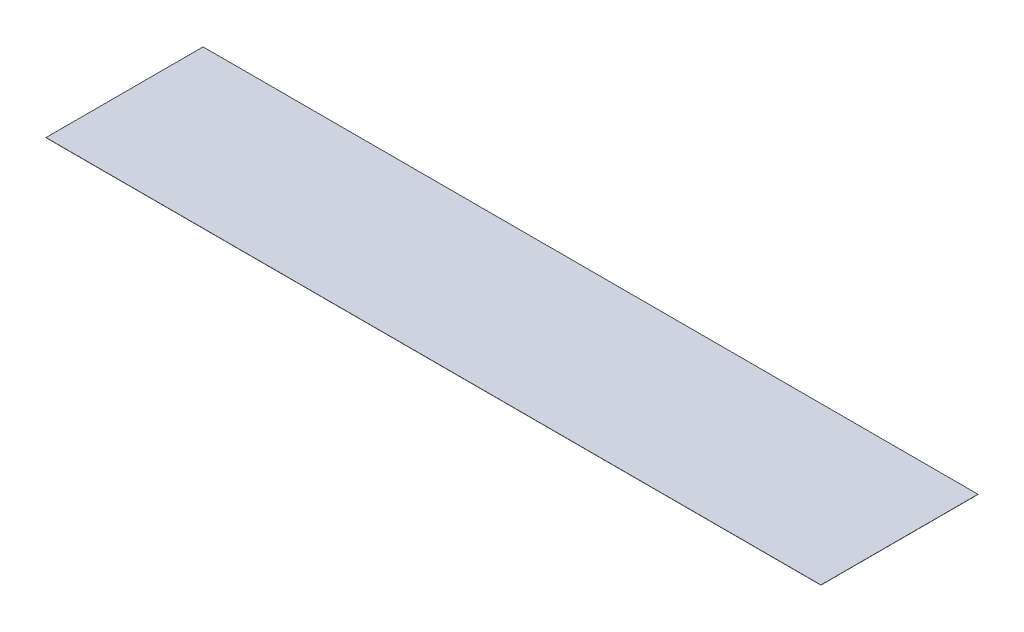
ISO-10303-21;
HEADER;
FILE_DESCRIPTION(('STEP AP214'),'2;1');
FILE_NAME('part.step','',(''),(''),'','','');
FILE_SCHEMA(('AUTOMOTIVE_DESIGN { 1 0 10303 214 1 1 1 1 }'));
ENDSEC;
DATA;
#1=APPLICATION_CONTEXT('core data for automotive mechanical design processes');
#2=APPLICATION_PROTOCOL_DEFINITION('international standard','automotive_design',2000,#1);
#3=PRODUCT_CONTEXT('',#1,'mechanical');
#4=PRODUCT('Part','Part','',(#3));
#5=PRODUCT_RELATED_PRODUCT_CATEGORY('part','',(#4));
#6=PRODUCT_DEFINITION_FORMATION('','',#4);
#7=PRODUCT_DEFINITION_CONTEXT('part definition',#1,'design');
#8=PRODUCT_DEFINITION('design','',#6,#7);
#9=PRODUCT_DEFINITION_SHAPE('','',#8);
#10=(LENGTH_UNIT() NAMED_UNIT(*) SI_UNIT(.MILLI.,.METRE.));
#11=(NAMED_UNIT(*) PLANE_ANGLE_UNIT() SI_UNIT($,.RADIAN.));
#12=(NAMED_UNIT(*) SI_UNIT($,.STERADIAN.) SOLID_ANGLE_UNIT());
#13=UNCERTAINTY_MEASURE_WITH_UNIT(LENGTH_MEASURE(1.E-05),#10,'distance_accuracy_value','');
#14=(GEOMETRIC_REPRESENTATION_CONTEXT(3) GLOBAL_UNCERTAINTY_ASSIGNED_CONTEXT((#13)) GLOBAL_UNIT_ASSIGNED_CONTEXT((#10,
#11,#12)) REPRESENTATION_CONTEXT('',''));
#15=CARTESIAN_POINT('',(0.,0.,0.));
#16=DIRECTION('',(0.,0.,1.));
#17=DIRECTION('',(1.,0.,0.));
#18=AXIS2_PLACEMENT_3D('',#15,#16,#17);
#19=CARTESIAN_POINT('',(-11277.6,4.7752,0.));
#20=DIRECTION('',(1.,0.,0.));
#21=DIRECTION('',(0.,0.,-1.));
#22=AXIS2_PLACEMENT_3D('',#19,#20,#21);
#23=PLANE('',#22);
#24=DIRECTION('',(0.,0.,1.));
#25=VECTOR('',#24,1.);
#26=CARTESIAN_POINT('',(-11277.6,0.,0.));
#27=LINE('',#26,#25);
#28=CARTESIAN_POINT('',(-11277.6,0.,-4572.));
#29=VERTEX_POINT('',#28);
#30=CARTESIAN_POINT('',(-11277.6,0.,0.));
#31=VERTEX_POINT('',#30);
#32=EDGE_CURVE('E104',#29,#31,#27,.T.);
#33=ORIENTED_EDGE('',*,*,#32,.T.);
#34=DIRECTION('',(0.,-1.,0.));
#35=VECTOR('',#34,1.);
#36=CARTESIAN_POINT('',(-11277.6,4.7752,0.));
#37=LINE('',#36,#35);
#38=CARTESIAN_POINT('',(-11277.6,4.7752,0.));
#39=VERTEX_POINT('',#38);
#40=EDGE_CURVE('E11',#39,#31,#37,.T.);
#41=ORIENTED_EDGE('',*,*,#40,.F.);
#42=DIRECTION('',(0.,0.,1.));
#43=VECTOR('',#42,1.);
#44=CARTESIAN_POINT('',(-11277.6,4.7752,0.));
#45=LINE('',#44,#43);
#46=CARTESIAN_POINT('',(-11277.6,4.7752,-4572.));
#47=VERTEX_POINT('',#46);
#48=EDGE_CURVE('E91',#47,#39,#45,.T.);
#49=ORIENTED_EDGE('',*,*,#48,.F.);
#50=DIRECTION('',(0.,-1.,0.));
#51=VECTOR('',#50,1.);
#52=CARTESIAN_POINT('',(-11277.6,4.7752,-4572.));
#53=LINE('',#52,#51);
#54=EDGE_CURVE('E100',#47,#29,#53,.T.);
#55=ORIENTED_EDGE('',*,*,#54,.T.);
#56=EDGE_LOOP('',(#33,#41,#49,#55));
#57=FACE_BOUND('',#56,.T.);
#58=ADVANCED_FACE('F40',(#57),#23,.F.);
#59=CARTESIAN_POINT('',(-11277.6,4.7752,0.));
#60=DIRECTION('',(0.,0.,-1.));
#61=DIRECTION('',(-1.,0.,0.));
#62=AXIS2_PLACEMENT_3D('',#59,#60,#61);
#63=PLANE('',#62);
#64=DIRECTION('',(1.,0.,0.));
#65=VECTOR('',#64,1.);
#66=CARTESIAN_POINT('',(-11277.6,0.,0.));
#67=LINE('',#66,#65);
#68=CARTESIAN_POINT('',(11277.6,0.,-4.21884749357559E-12));
#69=VERTEX_POINT('',#68);
#70=EDGE_CURVE('E96',#31,#69,#67,.T.);
#71=ORIENTED_EDGE('',*,*,#70,.T.);
#72=DIRECTION('',(0.,-1.,0.));
#73=VECTOR('',#72,1.);
#74=CARTESIAN_POINT('',(11277.6,4.7752,-4.21884749357559E-12));
#75=LINE('',#74,#73);
#76=CARTESIAN_POINT('',(11277.6,4.7752,-4.21884749357559E-12));
#77=VERTEX_POINT('',#76);
#78=EDGE_CURVE('E48',#77,#69,#75,.T.);
#79=ORIENTED_EDGE('',*,*,#78,.F.);
#80=DIRECTION('',(1.,0.,0.));
#81=VECTOR('',#80,1.);
#82=CARTESIAN_POINT('',(-11277.6,4.7752,0.));
#83=LINE('',#82,#81);
#84=EDGE_CURVE('E86',#39,#77,#83,.T.);
#85=ORIENTED_EDGE('',*,*,#84,.F.);
#86=ORIENTED_EDGE('',*,*,#40,.T.);
#87=EDGE_LOOP('',(#71,#79,#85,#86));
#88=FACE_BOUND('',#87,.T.);
#89=ADVANCED_FACE('F95',(#88),#63,.F.);
#90=CARTESIAN_POINT('',(11277.6,4.7752,-4.21884749357559E-12));
#91=DIRECTION('',(-1.,0.,0.));
#92=DIRECTION('',(0.,0.,1.));
#93=AXIS2_PLACEMENT_3D('',#90,#91,#92);
#94=PLANE('',#93);
#95=DIRECTION('',(0.,0.,-1.));
#96=VECTOR('',#95,1.);
#97=CARTESIAN_POINT('',(11277.6,0.,-4.21884749357559E-12));
#98=LINE('',#97,#96);
#99=CARTESIAN_POINT('',(11277.6,0.,-4572.));
#100=VERTEX_POINT('',#99);
#101=EDGE_CURVE('E73',#69,#100,#98,.T.);
#102=ORIENTED_EDGE('',*,*,#101,.T.);
#103=DIRECTION('',(0.,-1.,0.));
#104=VECTOR('',#103,1.);
#105=CARTESIAN_POINT('',(11277.6,4.7752,-4572.));
#106=LINE('',#105,#104);
#107=CARTESIAN_POINT('',(11277.6,4.7752,-4572.));
#108=VERTEX_POINT('',#107);
#109=EDGE_CURVE('E97',#108,#100,#106,.T.);
#110=ORIENTED_EDGE('',*,*,#109,.F.);
#111=DIRECTION('',(0.,0.,-1.));
#112=VECTOR('',#111,1.);
#113=CARTESIAN_POINT('',(11277.6,4.7752,-4.21884749357559E-12));
#114=LINE('',#113,#112);
#115=EDGE_CURVE('E89',#77,#108,#114,.T.);
#116=ORIENTED_EDGE('',*,*,#115,.F.);
#117=ORIENTED_EDGE('',*,*,#78,.T.);
#118=EDGE_LOOP('',(#102,#110,#116,#117));
#119=FACE_BOUND('',#118,.T.);
#120=ADVANCED_FACE('F98',(#119),#94,.F.);
#121=CARTESIAN_POINT('',(-11277.6,4.7752,-4572.));
#122=DIRECTION('',(0.,0.,1.));
#123=DIRECTION('',(1.,0.,0.));
#124=AXIS2_PLACEMENT_3D('',#121,#122,#123);
#125=PLANE('',#124);
#126=DIRECTION('',(-1.,0.,0.));
#127=VECTOR('',#126,1.);
#128=CARTESIAN_POINT('',(-11277.6,0.,-4572.));
#129=LINE('',#128,#127);
#130=EDGE_CURVE('E79',#100,#29,#129,.T.);
#131=ORIENTED_EDGE('',*,*,#130,.T.);
#132=ORIENTED_EDGE('',*,*,#54,.F.);
#133=DIRECTION('',(-1.,0.,0.));
#134=VECTOR('',#133,1.);
#135=CARTESIAN_POINT('',(-11277.6,4.7752,-4572.));
#136=LINE('',#135,#134);
#137=EDGE_CURVE('E56',#108,#47,#136,.T.);
#138=ORIENTED_EDGE('',*,*,#137,.F.);
#139=ORIENTED_EDGE('',*,*,#109,.T.);
#140=EDGE_LOOP('',(#131,#132,#138,#139));
#141=FACE_BOUND('',#140,.T.);
#142=ADVANCED_FACE('F112',(#141),#125,.F.);
#143=CARTESIAN_POINT('',(0.,4.7752,0.));
#144=DIRECTION('',(0.,-1.,0.));
#145=DIRECTION('',(0.,0.,-1.));
#146=AXIS2_PLACEMENT_3D('',#143,#144,#145);
#147=PLANE('',#146);
#148=ORIENTED_EDGE('',*,*,#48,.T.);
#149=ORIENTED_EDGE('',*,*,#84,.T.);
#150=ORIENTED_EDGE('',*,*,#115,.T.);
#151=ORIENTED_EDGE('',*,*,#137,.T.);
#152=EDGE_LOOP('',(#148,#149,#150,#151));
#153=FACE_BOUND('',#152,.T.);
#154=ADVANCED_FACE('F87',(#153),#147,.F.);
#155=CARTESIAN_POINT('',(0.,0.,0.));
#156=DIRECTION('',(0.,-1.,0.));
#157=DIRECTION('',(0.,0.,-1.));
#158=AXIS2_PLACEMENT_3D('',#155,#156,#157);
#159=PLANE('',#158);
#160=ORIENTED_EDGE('',*,*,#32,.F.);
#161=ORIENTED_EDGE('',*,*,#130,.F.);
#162=ORIENTED_EDGE('',*,*,#101,.F.);
#163=ORIENTED_EDGE('',*,*,#70,.F.);
#164=EDGE_LOOP('',(#160,#161,#162,#163));
#165=FACE_BOUND('',#164,.T.);
#166=ADVANCED_FACE('F115',(#165),#159,.T.);
#167=CLOSED_SHELL('',(#58,#89,#120,#142,#154,#166));
#168=MANIFOLD_SOLID_BREP('B2',#167);
#169=ADVANCED_BREP_SHAPE_REPRESENTATION('',(#18,#168),#14);
#170=SHAPE_DEFINITION_REPRESENTATION(#9,#169);
ENDSEC;
END-ISO-10303-21;
